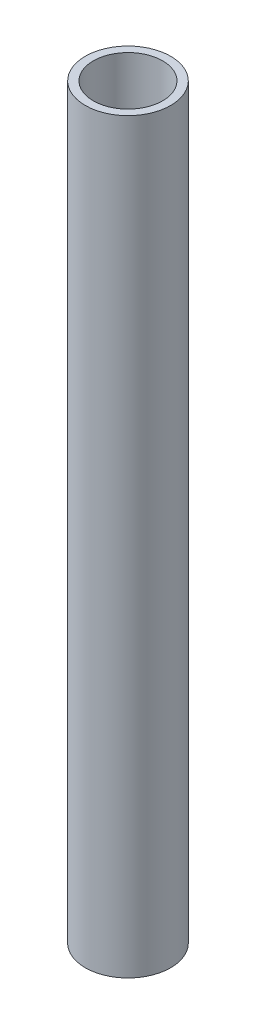
ISO-10303-21;
HEADER;
FILE_DESCRIPTION(('STEP AP214'),'2;1');
FILE_NAME('part.step','',(''),(''),'','','');
FILE_SCHEMA(('AUTOMOTIVE_DESIGN { 1 0 10303 214 1 1 1 1 }'));
ENDSEC;
DATA;
#1=APPLICATION_CONTEXT('core data for automotive mechanical design processes');
#2=APPLICATION_PROTOCOL_DEFINITION('international standard','automotive_design',2000,#1);
#3=PRODUCT_CONTEXT('',#1,'mechanical');
#4=PRODUCT('Part','Part','',(#3));
#5=PRODUCT_RELATED_PRODUCT_CATEGORY('part','',(#4));
#6=PRODUCT_DEFINITION_FORMATION('','',#4);
#7=PRODUCT_DEFINITION_CONTEXT('part definition',#1,'design');
#8=PRODUCT_DEFINITION('design','',#6,#7);
#9=PRODUCT_DEFINITION_SHAPE('','',#8);
#10=(LENGTH_UNIT() NAMED_UNIT(*) SI_UNIT(.MILLI.,.METRE.));
#11=(NAMED_UNIT(*) PLANE_ANGLE_UNIT() SI_UNIT($,.RADIAN.));
#12=(NAMED_UNIT(*) SI_UNIT($,.STERADIAN.) SOLID_ANGLE_UNIT());
#13=UNCERTAINTY_MEASURE_WITH_UNIT(LENGTH_MEASURE(1.E-05),#10,'distance_accuracy_value','');
#14=(GEOMETRIC_REPRESENTATION_CONTEXT(3) GLOBAL_UNCERTAINTY_ASSIGNED_CONTEXT((#13)) GLOBAL_UNIT_ASSIGNED_CONTEXT((#10,
#11,#12)) REPRESENTATION_CONTEXT('',''));
#15=CARTESIAN_POINT('',(0.,0.,0.));
#16=DIRECTION('',(0.,0.,1.));
#17=DIRECTION('',(1.,0.,0.));
#18=AXIS2_PLACEMENT_3D('',#15,#16,#17);
#19=CARTESIAN_POINT('',(0.,140.,0.));
#20=DIRECTION('',(0.,1.,0.));
#21=DIRECTION('',(0.,0.,1.));
#22=AXIS2_PLACEMENT_3D('',#19,#20,#21);
#23=PLANE('',#22);
#24=CARTESIAN_POINT('',(0.,140.,0.));
#25=DIRECTION('',(0.,1.,0.));
#26=DIRECTION('',(0.,0.,1.));
#27=AXIS2_PLACEMENT_3D('',#24,#25,#26);
#28=CIRCLE('',#27,8.);
#29=CARTESIAN_POINT('',(0.,140.,8.));
#30=VERTEX_POINT('',#29);
#31=EDGE_CURVE('E10',#30,#30,#28,.T.);
#32=ORIENTED_EDGE('',*,*,#31,.T.);
#33=EDGE_LOOP('',(#32));
#34=FACE_BOUND('',#33,.T.);
#35=CARTESIAN_POINT('',(0.,140.,0.));
#36=DIRECTION('',(0.,1.,0.));
#37=DIRECTION('',(0.,0.,1.));
#38=AXIS2_PLACEMENT_3D('',#35,#36,#37);
#39=CIRCLE('',#38,6.5);
#40=CARTESIAN_POINT('',(0.,140.,6.5));
#41=VERTEX_POINT('',#40);
#42=EDGE_CURVE('E41',#41,#41,#39,.T.);
#43=ORIENTED_EDGE('',*,*,#42,.F.);
#44=EDGE_LOOP('',(#43));
#45=FACE_BOUND('',#44,.T.);
#46=ADVANCED_FACE('F30',(#34,#45),#23,.T.);
#47=CARTESIAN_POINT('',(0.,0.,0.));
#48=DIRECTION('',(0.,1.,0.));
#49=DIRECTION('',(0.,0.,1.));
#50=AXIS2_PLACEMENT_3D('',#47,#48,#49);
#51=PLANE('',#50);
#52=CARTESIAN_POINT('',(0.,0.,0.));
#53=DIRECTION('',(0.,1.,0.));
#54=DIRECTION('',(0.,0.,1.));
#55=AXIS2_PLACEMENT_3D('',#52,#53,#54);
#56=CIRCLE('',#55,8.);
#57=CARTESIAN_POINT('',(0.,0.,8.));
#58=VERTEX_POINT('',#57);
#59=EDGE_CURVE('E34',#58,#58,#56,.T.);
#60=ORIENTED_EDGE('',*,*,#59,.F.);
#61=EDGE_LOOP('',(#60));
#62=FACE_BOUND('',#61,.T.);
#63=CARTESIAN_POINT('',(0.,0.,0.));
#64=DIRECTION('',(0.,1.,0.));
#65=DIRECTION('',(0.,0.,1.));
#66=AXIS2_PLACEMENT_3D('',#63,#64,#65);
#67=CIRCLE('',#66,6.5);
#68=CARTESIAN_POINT('',(0.,0.,6.5));
#69=VERTEX_POINT('',#68);
#70=EDGE_CURVE('E43',#69,#69,#67,.T.);
#71=ORIENTED_EDGE('',*,*,#70,.T.);
#72=EDGE_LOOP('',(#71));
#73=FACE_BOUND('',#72,.T.);
#74=ADVANCED_FACE('F53',(#62,#73),#51,.F.);
#75=CARTESIAN_POINT('',(0.,140.,0.));
#76=DIRECTION('',(0.,-1.,0.));
#77=DIRECTION('',(0.,0.,-1.));
#78=AXIS2_PLACEMENT_3D('',#75,#76,#77);
#79=CYLINDRICAL_SURFACE('',#78,8.);
#80=ORIENTED_EDGE('',*,*,#31,.F.);
#81=EDGE_LOOP('',(#80));
#82=FACE_BOUND('',#81,.T.);
#83=ORIENTED_EDGE('',*,*,#59,.T.);
#84=EDGE_LOOP('',(#83));
#85=FACE_BOUND('',#84,.T.);
#86=ADVANCED_FACE('F32',(#82,#85),#79,.T.);
#87=CARTESIAN_POINT('',(0.,140.,0.));
#88=DIRECTION('',(0.,-1.,0.));
#89=DIRECTION('',(0.,0.,-1.));
#90=AXIS2_PLACEMENT_3D('',#87,#88,#89);
#91=CYLINDRICAL_SURFACE('',#90,6.5);
#92=ORIENTED_EDGE('',*,*,#42,.T.);
#93=EDGE_LOOP('',(#92));
#94=FACE_BOUND('',#93,.T.);
#95=ORIENTED_EDGE('',*,*,#70,.F.);
#96=EDGE_LOOP('',(#95));
#97=FACE_BOUND('',#96,.T.);
#98=ADVANCED_FACE('F49',(#94,#97),#91,.F.);
#99=CLOSED_SHELL('',(#46,#74,#86,#98));
#100=MANIFOLD_SOLID_BREP('B2',#99);
#101=ADVANCED_BREP_SHAPE_REPRESENTATION('',(#18,#100),#14);
#102=SHAPE_DEFINITION_REPRESENTATION(#9,#101);
ENDSEC;
END-ISO-10303-21;
